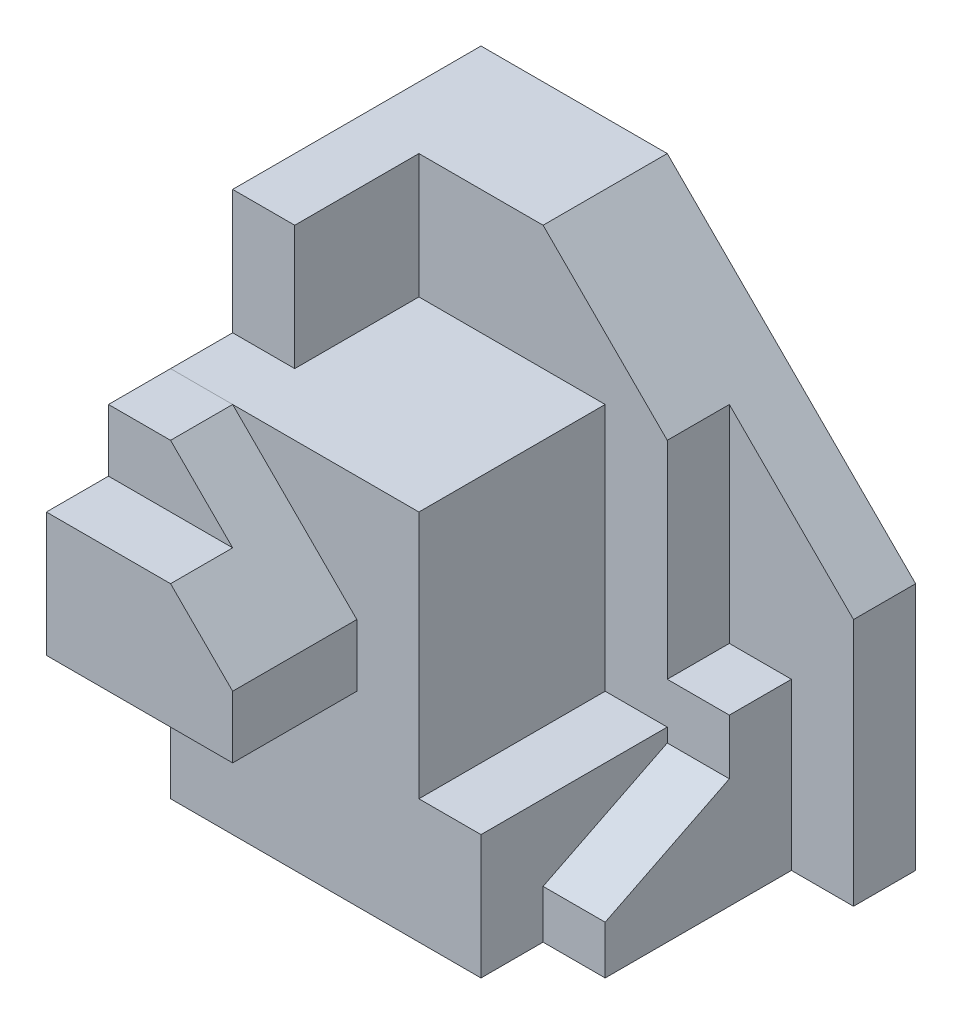
ISO-10303-21;
HEADER;
FILE_DESCRIPTION(('STEP AP214'),'2;1');
FILE_NAME('part.step','',(''),(''),'','','');
FILE_SCHEMA(('AUTOMOTIVE_DESIGN { 1 0 10303 214 1 1 1 1 }'));
ENDSEC;
DATA;
#1=APPLICATION_CONTEXT('core data for automotive mechanical design processes');
#2=APPLICATION_PROTOCOL_DEFINITION('international standard','automotive_design',2000,#1);
#3=PRODUCT_CONTEXT('',#1,'mechanical');
#4=PRODUCT('Part','Part','',(#3));
#5=PRODUCT_RELATED_PRODUCT_CATEGORY('part','',(#4));
#6=PRODUCT_DEFINITION_FORMATION('','',#4);
#7=PRODUCT_DEFINITION_CONTEXT('part definition',#1,'design');
#8=PRODUCT_DEFINITION('design','',#6,#7);
#9=PRODUCT_DEFINITION_SHAPE('','',#8);
#10=(LENGTH_UNIT() NAMED_UNIT(*) SI_UNIT(.MILLI.,.METRE.));
#11=(NAMED_UNIT(*) PLANE_ANGLE_UNIT() SI_UNIT($,.RADIAN.));
#12=(NAMED_UNIT(*) SI_UNIT($,.STERADIAN.) SOLID_ANGLE_UNIT());
#13=UNCERTAINTY_MEASURE_WITH_UNIT(LENGTH_MEASURE(1.E-05),#10,'distance_accuracy_value','');
#14=(GEOMETRIC_REPRESENTATION_CONTEXT(3) GLOBAL_UNCERTAINTY_ASSIGNED_CONTEXT((#13)) GLOBAL_UNIT_ASSIGNED_CONTEXT((#10,
#11,#12)) REPRESENTATION_CONTEXT('',''));
#15=CARTESIAN_POINT('',(0.,0.,0.));
#16=DIRECTION('',(0.,0.,1.));
#17=DIRECTION('',(1.,0.,0.));
#18=AXIS2_PLACEMENT_3D('',#15,#16,#17);
#19=CARTESIAN_POINT('',(-25.,30.,25.));
#20=DIRECTION('',(-1.,0.,0.));
#21=DIRECTION('',(0.,0.,1.));
#22=AXIS2_PLACEMENT_3D('',#19,#20,#21);
#23=PLANE('',#22);
#24=DIRECTION('',(0.,0.,1.));
#25=VECTOR('',#24,1.);
#26=CARTESIAN_POINT('',(-25.,50.,45.));
#27=LINE('',#26,#25);
#28=CARTESIAN_POINT('',(-25.,50.,35.));
#29=VERTEX_POINT('',#28);
#30=CARTESIAN_POINT('',(-25.,50.,45.));
#31=VERTEX_POINT('',#30);
#32=EDGE_CURVE('E109',#29,#31,#27,.T.);
#33=ORIENTED_EDGE('',*,*,#32,.F.);
#34=DIRECTION('',(0.,-1.,0.));
#35=VECTOR('',#34,1.);
#36=CARTESIAN_POINT('',(-25.,60.,35.));
#37=LINE('',#36,#35);
#38=CARTESIAN_POINT('',(-25.,60.,35.));
#39=VERTEX_POINT('',#38);
#40=EDGE_CURVE('E103',#39,#29,#37,.T.);
#41=ORIENTED_EDGE('',*,*,#40,.F.);
#42=DIRECTION('',(0.,0.,1.));
#43=VECTOR('',#42,1.);
#44=CARTESIAN_POINT('',(-25.,60.,25.));
#45=LINE('',#44,#43);
#46=CARTESIAN_POINT('',(-25.,60.,25.));
#47=VERTEX_POINT('',#46);
#48=EDGE_CURVE('E113',#47,#39,#45,.T.);
#49=ORIENTED_EDGE('',*,*,#48,.F.);
#50=DIRECTION('',(0.,1.,0.));
#51=VECTOR('',#50,1.);
#52=CARTESIAN_POINT('',(-25.,30.,25.));
#53=LINE('',#52,#51);
#54=CARTESIAN_POINT('',(-25.,30.,25.));
#55=VERTEX_POINT('',#54);
#56=EDGE_CURVE('E130',#55,#47,#53,.T.);
#57=ORIENTED_EDGE('',*,*,#56,.F.);
#58=DIRECTION('',(0.,0.,1.));
#59=VECTOR('',#58,1.);
#60=CARTESIAN_POINT('',(-25.,30.,25.));
#61=LINE('',#60,#59);
#62=CARTESIAN_POINT('',(-25.,30.,45.));
#63=VERTEX_POINT('',#62);
#64=EDGE_CURVE('E122',#55,#63,#61,.T.);
#65=ORIENTED_EDGE('',*,*,#64,.T.);
#66=DIRECTION('',(0.,1.,0.));
#67=VECTOR('',#66,1.);
#68=CARTESIAN_POINT('',(-25.,30.,45.));
#69=LINE('',#68,#67);
#70=EDGE_CURVE('E137',#63,#31,#69,.T.);
#71=ORIENTED_EDGE('',*,*,#70,.T.);
#72=EDGE_LOOP('',(#33,#41,#49,#57,#65,#71));
#73=FACE_BOUND('',#72,.T.);
#74=ADVANCED_FACE('F43',(#73),#23,.T.);
#75=CARTESIAN_POINT('',(-25.,30.,25.));
#76=DIRECTION('',(0.,0.,-1.));
#77=DIRECTION('',(-1.,0.,0.));
#78=AXIS2_PLACEMENT_3D('',#75,#76,#77);
#79=PLANE('',#78);
#80=DIRECTION('',(-1.,0.,0.));
#81=VECTOR('',#80,1.);
#82=CARTESIAN_POINT('',(-25.,60.,25.));
#83=LINE('',#82,#81);
#84=CARTESIAN_POINT('',(-15.0000000000001,60.,25.));
#85=VERTEX_POINT('',#84);
#86=EDGE_CURVE('E118',#85,#47,#83,.T.);
#87=ORIENTED_EDGE('',*,*,#86,.F.);
#88=DIRECTION('',(-0.707106781186547,0.707106781186548,0.));
#89=VECTOR('',#88,1.);
#90=CARTESIAN_POINT('',(-5.00000000000003,50.,25.));
#91=LINE('',#90,#89);
#92=CARTESIAN_POINT('',(5.,39.9999999999999,25.));
#93=VERTEX_POINT('',#92);
#94=EDGE_CURVE('E140',#85,#93,#91,.F.);
#95=ORIENTED_EDGE('',*,*,#94,.T.);
#96=DIRECTION('',(0.,1.,0.));
#97=VECTOR('',#96,1.);
#98=CARTESIAN_POINT('',(5.,30.,25.));
#99=LINE('',#98,#97);
#100=CARTESIAN_POINT('',(5.,30.,25.));
#101=VERTEX_POINT('',#100);
#102=EDGE_CURVE('E133',#101,#93,#99,.T.);
#103=ORIENTED_EDGE('',*,*,#102,.F.);
#104=DIRECTION('',(-1.,0.,0.));
#105=VECTOR('',#104,1.);
#106=CARTESIAN_POINT('',(-25.,30.,25.));
#107=LINE('',#106,#105);
#108=EDGE_CURVE('E127',#101,#55,#107,.T.);
#109=ORIENTED_EDGE('',*,*,#108,.T.);
#110=ORIENTED_EDGE('',*,*,#56,.T.);
#111=EDGE_LOOP('',(#87,#95,#103,#109,#110));
#112=FACE_BOUND('',#111,.T.);
#113=ADVANCED_FACE('F166',(#112),#79,.T.);
#114=CARTESIAN_POINT('',(5.,30.,25.));
#115=DIRECTION('',(1.,0.,0.));
#116=DIRECTION('',(0.,0.,-1.));
#117=AXIS2_PLACEMENT_3D('',#114,#115,#116);
#118=PLANE('',#117);
#119=ORIENTED_EDGE('',*,*,#102,.T.);
#120=DIRECTION('',(0.,0.,1.));
#121=VECTOR('',#120,1.);
#122=CARTESIAN_POINT('',(5.,39.9999999999999,25.));
#123=LINE('',#122,#121);
#124=CARTESIAN_POINT('',(5.00000000000001,39.9999999999999,45.));
#125=VERTEX_POINT('',#124);
#126=EDGE_CURVE('E65',#93,#125,#123,.T.);
#127=ORIENTED_EDGE('',*,*,#126,.T.);
#128=DIRECTION('',(0.,1.,0.));
#129=VECTOR('',#128,1.);
#130=CARTESIAN_POINT('',(5.,30.,45.));
#131=LINE('',#130,#129);
#132=CARTESIAN_POINT('',(5.,30.,45.));
#133=VERTEX_POINT('',#132);
#134=EDGE_CURVE('E135',#133,#125,#131,.T.);
#135=ORIENTED_EDGE('',*,*,#134,.F.);
#136=DIRECTION('',(0.,0.,-1.));
#137=VECTOR('',#136,1.);
#138=CARTESIAN_POINT('',(5.,30.,25.));
#139=LINE('',#138,#137);
#140=EDGE_CURVE('E160',#133,#101,#139,.T.);
#141=ORIENTED_EDGE('',*,*,#140,.T.);
#142=EDGE_LOOP('',(#119,#127,#135,#141));
#143=FACE_BOUND('',#142,.T.);
#144=ADVANCED_FACE('F178',(#143),#118,.T.);
#145=CARTESIAN_POINT('',(-25.,30.,45.));
#146=DIRECTION('',(0.,0.,1.));
#147=DIRECTION('',(1.,0.,0.));
#148=AXIS2_PLACEMENT_3D('',#145,#146,#147);
#149=PLANE('',#148);
#150=DIRECTION('',(-1.,0.,0.));
#151=VECTOR('',#150,1.);
#152=CARTESIAN_POINT('',(15.,50.,45.));
#153=LINE('',#152,#151);
#154=CARTESIAN_POINT('',(-5.00000000000006,50.,45.));
#155=VERTEX_POINT('',#154);
#156=EDGE_CURVE('E120',#155,#31,#153,.T.);
#157=ORIENTED_EDGE('',*,*,#156,.T.);
#158=ORIENTED_EDGE('',*,*,#70,.F.);
#159=DIRECTION('',(1.,0.,0.));
#160=VECTOR('',#159,1.);
#161=CARTESIAN_POINT('',(-25.,30.,45.));
#162=LINE('',#161,#160);
#163=EDGE_CURVE('E159',#63,#133,#162,.T.);
#164=ORIENTED_EDGE('',*,*,#163,.T.);
#165=ORIENTED_EDGE('',*,*,#134,.T.);
#166=DIRECTION('',(0.707106781186547,-0.707106781186548,0.));
#167=VECTOR('',#166,1.);
#168=CARTESIAN_POINT('',(-5.00000000000002,50.,45.));
#169=LINE('',#168,#167);
#170=EDGE_CURVE('E143',#125,#155,#169,.F.);
#171=ORIENTED_EDGE('',*,*,#170,.T.);
#172=EDGE_LOOP('',(#157,#158,#164,#165,#171));
#173=FACE_BOUND('',#172,.T.);
#174=ADVANCED_FACE('F147',(#173),#149,.T.);
#175=CARTESIAN_POINT('',(0.,30.,0.));
#176=DIRECTION('',(0.,1.,0.));
#177=DIRECTION('',(0.,0.,1.));
#178=AXIS2_PLACEMENT_3D('',#175,#176,#177);
#179=PLANE('',#178);
#180=ORIENTED_EDGE('',*,*,#64,.F.);
#181=ORIENTED_EDGE('',*,*,#108,.F.);
#182=ORIENTED_EDGE('',*,*,#140,.F.);
#183=ORIENTED_EDGE('',*,*,#163,.F.);
#184=EDGE_LOOP('',(#180,#181,#182,#183));
#185=FACE_BOUND('',#184,.T.);
#186=ADVANCED_FACE('F169',(#185),#179,.F.);
#187=CARTESIAN_POINT('',(0.,60.,0.));
#188=DIRECTION('',(0.,1.,0.));
#189=DIRECTION('',(0.,0.,1.));
#190=AXIS2_PLACEMENT_3D('',#187,#188,#189);
#191=PLANE('',#190);
#192=DIRECTION('',(-1.,0.,0.));
#193=VECTOR('',#192,1.);
#194=CARTESIAN_POINT('',(15.,60.,35.));
#195=LINE('',#194,#193);
#196=CARTESIAN_POINT('',(-15.0000000000001,60.,35.));
#197=VERTEX_POINT('',#196);
#198=EDGE_CURVE('E100',#197,#39,#195,.T.);
#199=ORIENTED_EDGE('',*,*,#198,.F.);
#200=DIRECTION('',(0.,0.,-1.));
#201=VECTOR('',#200,1.);
#202=CARTESIAN_POINT('',(-15.0000000000001,60.,0.));
#203=LINE('',#202,#201);
#204=EDGE_CURVE('E132',#197,#85,#203,.T.);
#205=ORIENTED_EDGE('',*,*,#204,.T.);
#206=ORIENTED_EDGE('',*,*,#86,.T.);
#207=ORIENTED_EDGE('',*,*,#48,.T.);
#208=EDGE_LOOP('',(#199,#205,#206,#207));
#209=FACE_BOUND('',#208,.T.);
#210=ADVANCED_FACE('F116',(#209),#191,.T.);
#211=CARTESIAN_POINT('',(-15.0000000000001,60.,0.));
#212=DIRECTION('',(-0.707106781186548,-0.707106781186547,0.));
#213=DIRECTION('',(0.,0.,-1.));
#214=AXIS2_PLACEMENT_3D('',#211,#212,#213);
#215=PLANE('',#214);
#216=DIRECTION('',(0.,0.,1.));
#217=VECTOR('',#216,1.);
#218=CARTESIAN_POINT('',(-5.00000000000007,50.,0.));
#219=LINE('',#218,#217);
#220=CARTESIAN_POINT('',(-5.00000000000006,50.,35.));
#221=VERTEX_POINT('',#220);
#222=EDGE_CURVE('E12',#155,#221,#219,.F.);
#223=ORIENTED_EDGE('',*,*,#222,.F.);
#224=ORIENTED_EDGE('',*,*,#170,.F.);
#225=ORIENTED_EDGE('',*,*,#126,.F.);
#226=ORIENTED_EDGE('',*,*,#94,.F.);
#227=ORIENTED_EDGE('',*,*,#204,.F.);
#228=DIRECTION('',(0.707106781186547,-0.707106781186548,0.));
#229=VECTOR('',#228,1.);
#230=CARTESIAN_POINT('',(-15.0000000000001,60.,35.));
#231=LINE('',#230,#229);
#232=EDGE_CURVE('E51',#221,#197,#231,.F.);
#233=ORIENTED_EDGE('',*,*,#232,.F.);
#234=EDGE_LOOP('',(#223,#224,#225,#226,#227,#233));
#235=FACE_BOUND('',#234,.T.);
#236=ADVANCED_FACE('F45',(#235),#215,.F.);
#237=CARTESIAN_POINT('',(15.,50.,45.));
#238=DIRECTION('',(0.,-1.,0.));
#239=DIRECTION('',(0.,0.,-1.));
#240=AXIS2_PLACEMENT_3D('',#237,#238,#239);
#241=PLANE('',#240);
#242=ORIENTED_EDGE('',*,*,#222,.T.);
#243=DIRECTION('',(-1.,0.,0.));
#244=VECTOR('',#243,1.);
#245=CARTESIAN_POINT('',(15.,50.,35.));
#246=LINE('',#245,#244);
#247=EDGE_CURVE('E58',#221,#29,#246,.T.);
#248=ORIENTED_EDGE('',*,*,#247,.T.);
#249=ORIENTED_EDGE('',*,*,#32,.T.);
#250=ORIENTED_EDGE('',*,*,#156,.F.);
#251=EDGE_LOOP('',(#242,#248,#249,#250));
#252=FACE_BOUND('',#251,.T.);
#253=ADVANCED_FACE('F153',(#252),#241,.F.);
#254=CARTESIAN_POINT('',(15.,60.,35.));
#255=DIRECTION('',(0.,0.,-1.));
#256=DIRECTION('',(-1.,0.,0.));
#257=AXIS2_PLACEMENT_3D('',#254,#255,#256);
#258=PLANE('',#257);
#259=ORIENTED_EDGE('',*,*,#232,.T.);
#260=ORIENTED_EDGE('',*,*,#198,.T.);
#261=ORIENTED_EDGE('',*,*,#40,.T.);
#262=ORIENTED_EDGE('',*,*,#247,.F.);
#263=EDGE_LOOP('',(#259,#260,#261,#262));
#264=FACE_BOUND('',#263,.T.);
#265=ADVANCED_FACE('F102',(#264),#258,.F.);
#266=CLOSED_SHELL('',(#74,#113,#144,#174,#186,#210,#236,#253,#265));
#267=MANIFOLD_SOLID_BREP('B2',#266);
#268=CARTESIAN_POINT('',(25.,60.,25.));
#269=DIRECTION('',(-1.,0.,0.));
#270=DIRECTION('',(0.,0.,1.));
#271=AXIS2_PLACEMENT_3D('',#268,#269,#270);
#272=PLANE('',#271);
#273=DIRECTION('',(0.,0.,1.));
#274=VECTOR('',#273,1.);
#275=CARTESIAN_POINT('',(25.,26.6693121097361,-5.));
#276=LINE('',#275,#274);
#277=CARTESIAN_POINT('',(25.,26.6693121097361,-15.));
#278=VERTEX_POINT('',#277);
#279=CARTESIAN_POINT('',(25.,26.6693121097361,-5.));
#280=VERTEX_POINT('',#279);
#281=EDGE_CURVE('E390',#278,#280,#276,.T.);
#282=ORIENTED_EDGE('',*,*,#281,.F.);
#283=DIRECTION('',(0.,-1.,0.));
#284=VECTOR('',#283,1.);
#285=CARTESIAN_POINT('',(25.,0.,-15.));
#286=LINE('',#285,#284);
#287=CARTESIAN_POINT('',(25.,59.9999999999999,-15.));
#288=VERTEX_POINT('',#287);
#289=EDGE_CURVE('E434',#288,#278,#286,.T.);
#290=ORIENTED_EDGE('',*,*,#289,.F.);
#291=DIRECTION('',(0.,0.,1.));
#292=VECTOR('',#291,1.);
#293=CARTESIAN_POINT('',(25.,59.9999999999999,0.));
#294=LINE('',#293,#292);
#295=CARTESIAN_POINT('',(25.,59.9999999999999,-5.));
#296=VERTEX_POINT('',#295);
#297=EDGE_CURVE('E443',#288,#296,#294,.T.);
#298=ORIENTED_EDGE('',*,*,#297,.T.);
#299=DIRECTION('',(0.,1.,0.));
#300=VECTOR('',#299,1.);
#301=CARTESIAN_POINT('',(25.,20.,-5.));
#302=LINE('',#301,#300);
#303=EDGE_CURVE('E509',#280,#296,#302,.T.);
#304=ORIENTED_EDGE('',*,*,#303,.F.);
#305=EDGE_LOOP('',(#282,#290,#298,#304));
#306=FACE_BOUND('',#305,.T.);
#307=ADVANCED_FACE('F245',(#306),#272,.F.);
#308=DIRECTION('',(0.,-1.,0.));
#309=VECTOR('',#308,1.);
#310=CARTESIAN_POINT('',(25.,17.7822035162268,-5.));
#311=LINE('',#310,#309);
#312=CARTESIAN_POINT('',(25.,20.,-5.));
#313=VERTEX_POINT('',#312);
#314=CARTESIAN_POINT('',(25.,17.7822035162268,-5.));
#315=VERTEX_POINT('',#314);
#316=EDGE_CURVE('E532',#313,#315,#311,.T.);
#317=ORIENTED_EDGE('',*,*,#316,.F.);
#318=DIRECTION('',(0.,0.,-1.));
#319=VECTOR('',#318,1.);
#320=CARTESIAN_POINT('',(25.,20.,25.));
#321=LINE('',#320,#319);
#322=CARTESIAN_POINT('',(25.,20.,25.));
#323=VERTEX_POINT('',#322);
#324=EDGE_CURVE('E518',#323,#313,#321,.T.);
#325=ORIENTED_EDGE('',*,*,#324,.F.);
#326=DIRECTION('',(0.,-1.,0.));
#327=VECTOR('',#326,1.);
#328=CARTESIAN_POINT('',(25.,60.,25.));
#329=LINE('',#328,#327);
#330=CARTESIAN_POINT('',(25.,0.,25.));
#331=VERTEX_POINT('',#330);
#332=EDGE_CURVE('E499',#323,#331,#329,.T.);
#333=ORIENTED_EDGE('',*,*,#332,.T.);
#334=DIRECTION('',(0.,0.,-1.));
#335=VECTOR('',#334,1.);
#336=CARTESIAN_POINT('',(25.,0.,25.));
#337=LINE('',#336,#335);
#338=CARTESIAN_POINT('',(25.,0.,15.));
#339=VERTEX_POINT('',#338);
#340=EDGE_CURVE('E482',#331,#339,#337,.T.);
#341=ORIENTED_EDGE('',*,*,#340,.T.);
#342=DIRECTION('',(0.,-1.,0.));
#343=VECTOR('',#342,1.);
#344=CARTESIAN_POINT('',(25.,0.,15.));
#345=LINE('',#344,#343);
#346=CARTESIAN_POINT('',(25.,7.78220351622677,15.));
#347=VERTEX_POINT('',#346);
#348=EDGE_CURVE('E265',#347,#339,#345,.T.);
#349=ORIENTED_EDGE('',*,*,#348,.F.);
#350=DIRECTION('',(0.,-0.447213595499958,0.894427190999916));
#351=VECTOR('',#350,1.);
#352=CARTESIAN_POINT('',(25.,7.78220351622677,15.));
#353=LINE('',#352,#351);
#354=EDGE_CURVE('E260',#315,#347,#353,.T.);
#355=ORIENTED_EDGE('',*,*,#354,.F.);
#356=EDGE_LOOP('',(#317,#325,#333,#341,#349,#355));
#357=FACE_BOUND('',#356,.T.);
#358=ADVANCED_FACE('F531',(#357),#272,.F.);
#359=CARTESIAN_POINT('',(45.,0.,-15.));
#360=DIRECTION('',(0.,0.,-1.));
#361=DIRECTION('',(-1.,0.,0.));
#362=AXIS2_PLACEMENT_3D('',#359,#360,#361);
#363=PLANE('',#362);
#364=DIRECTION('',(-1.,0.,0.));
#365=VECTOR('',#364,1.);
#366=CARTESIAN_POINT('',(35.,26.6693121097361,-15.));
#367=LINE('',#366,#365);
#368=CARTESIAN_POINT('',(35.,26.6693121097361,-15.));
#369=VERTEX_POINT('',#368);
#370=EDGE_CURVE('E548',#369,#278,#367,.T.);
#371=ORIENTED_EDGE('',*,*,#370,.F.);
#372=DIRECTION('',(0.,1.,0.));
#373=VECTOR('',#372,1.);
#374=CARTESIAN_POINT('',(35.,26.6693121097361,-15.));
#375=LINE('',#374,#373);
#376=CARTESIAN_POINT('',(35.,0.,-15.));
#377=VERTEX_POINT('',#376);
#378=EDGE_CURVE('E385',#377,#369,#375,.T.);
#379=ORIENTED_EDGE('',*,*,#378,.F.);
#380=DIRECTION('',(-1.,0.,0.));
#381=VECTOR('',#380,1.);
#382=CARTESIAN_POINT('',(45.,0.,-15.));
#383=LINE('',#382,#381);
#384=CARTESIAN_POINT('',(45.,0.,-15.));
#385=VERTEX_POINT('',#384);
#386=EDGE_CURVE('E428',#385,#377,#383,.T.);
#387=ORIENTED_EDGE('',*,*,#386,.F.);
#388=DIRECTION('',(0.,-1.,0.));
#389=VECTOR('',#388,1.);
#390=CARTESIAN_POINT('',(45.,0.,-15.));
#391=LINE('',#390,#389);
#392=CARTESIAN_POINT('',(45.,39.9999999999999,-15.));
#393=VERTEX_POINT('',#392);
#394=EDGE_CURVE('E423',#393,#385,#391,.T.);
#395=ORIENTED_EDGE('',*,*,#394,.F.);
#396=DIRECTION('',(-0.707106781186548,0.707106781186548,0.));
#397=VECTOR('',#396,1.);
#398=CARTESIAN_POINT('',(45.,39.9999999999999,-15.));
#399=LINE('',#398,#397);
#400=EDGE_CURVE('E441',#393,#288,#399,.T.);
#401=ORIENTED_EDGE('',*,*,#400,.T.);
#402=ORIENTED_EDGE('',*,*,#289,.T.);
#403=EDGE_LOOP('',(#371,#379,#387,#395,#401,#402));
#404=FACE_BOUND('',#403,.T.);
#405=ADVANCED_FACE('F470',(#404),#363,.F.);
#406=CARTESIAN_POINT('',(0.,60.,0.));
#407=DIRECTION('',(0.,-1.,0.));
#408=DIRECTION('',(0.,0.,-1.));
#409=AXIS2_PLACEMENT_3D('',#406,#407,#408);
#410=PLANE('',#409);
#411=DIRECTION('',(1.,0.,0.));
#412=VECTOR('',#411,1.);
#413=CARTESIAN_POINT('',(-25.,60.,15.));
#414=LINE('',#413,#412);
#415=CARTESIAN_POINT('',(-25.,60.,15.));
#416=VERTEX_POINT('',#415);
#417=CARTESIAN_POINT('',(-15.,60.,15.));
#418=VERTEX_POINT('',#417);
#419=EDGE_CURVE('E391',#416,#418,#414,.T.);
#420=ORIENTED_EDGE('',*,*,#419,.F.);
#421=DIRECTION('',(0.,0.,1.));
#422=VECTOR('',#421,1.);
#423=CARTESIAN_POINT('',(-25.,60.,25.));
#424=LINE('',#423,#422);
#425=CARTESIAN_POINT('',(-25.,60.,25.));
#426=VERTEX_POINT('',#425);
#427=EDGE_CURVE('E495',#416,#426,#424,.T.);
#428=ORIENTED_EDGE('',*,*,#427,.T.);
#429=DIRECTION('',(1.,0.,0.));
#430=VECTOR('',#429,1.);
#431=CARTESIAN_POINT('',(-25.,60.,25.));
#432=LINE('',#431,#430);
#433=CARTESIAN_POINT('',(15.,60.,25.));
#434=VERTEX_POINT('',#433);
#435=EDGE_CURVE('E501',#426,#434,#432,.T.);
#436=ORIENTED_EDGE('',*,*,#435,.T.);
#437=DIRECTION('',(0.,0.,1.));
#438=VECTOR('',#437,1.);
#439=CARTESIAN_POINT('',(15.,60.,25.));
#440=LINE('',#439,#438);
#441=CARTESIAN_POINT('',(15.,60.,-5.));
#442=VERTEX_POINT('',#441);
#443=EDGE_CURVE('E461',#442,#434,#440,.T.);
#444=ORIENTED_EDGE('',*,*,#443,.F.);
#445=DIRECTION('',(1.,0.,0.));
#446=VECTOR('',#445,1.);
#447=CARTESIAN_POINT('',(-15.,60.,-5.));
#448=LINE('',#447,#446);
#449=CARTESIAN_POINT('',(-15.,60.,-5.));
#450=VERTEX_POINT('',#449);
#451=EDGE_CURVE('E403',#450,#442,#448,.T.);
#452=ORIENTED_EDGE('',*,*,#451,.F.);
#453=DIRECTION('',(0.,0.,-1.));
#454=VECTOR('',#453,1.);
#455=CARTESIAN_POINT('',(-15.,60.,15.));
#456=LINE('',#455,#454);
#457=EDGE_CURVE('E393',#418,#450,#456,.T.);
#458=ORIENTED_EDGE('',*,*,#457,.F.);
#459=EDGE_LOOP('',(#420,#428,#436,#444,#452,#458));
#460=FACE_BOUND('',#459,.T.);
#461=ADVANCED_FACE('F575',(#460),#410,.F.);
#462=CARTESIAN_POINT('',(-25.,60.,-25.));
#463=DIRECTION('',(0.,0.,1.));
#464=DIRECTION('',(1.,0.,0.));
#465=AXIS2_PLACEMENT_3D('',#462,#463,#464);
#466=PLANE('',#465);
#467=DIRECTION('',(-1.,0.,0.));
#468=VECTOR('',#467,1.);
#469=CARTESIAN_POINT('',(45.,80.,-25.));
#470=LINE('',#469,#468);
#471=CARTESIAN_POINT('',(4.99999999999986,80.,-25.));
#472=VERTEX_POINT('',#471);
#473=CARTESIAN_POINT('',(-25.,80.,-25.));
#474=VERTEX_POINT('',#473);
#475=EDGE_CURVE('E431',#472,#474,#470,.T.);
#476=ORIENTED_EDGE('',*,*,#475,.F.);
#477=DIRECTION('',(0.707106781186548,-0.707106781186548,0.));
#478=VECTOR('',#477,1.);
#479=CARTESIAN_POINT('',(45.,39.9999999999999,-25.));
#480=LINE('',#479,#478);
#481=CARTESIAN_POINT('',(45.,39.9999999999999,-25.));
#482=VERTEX_POINT('',#481);
#483=EDGE_CURVE('E41',#472,#482,#480,.T.);
#484=ORIENTED_EDGE('',*,*,#483,.T.);
#485=DIRECTION('',(0.,1.,0.));
#486=VECTOR('',#485,1.);
#487=CARTESIAN_POINT('',(45.,0.,-25.));
#488=LINE('',#487,#486);
#489=CARTESIAN_POINT('',(45.,0.,-25.));
#490=VERTEX_POINT('',#489);
#491=EDGE_CURVE('E420',#490,#482,#488,.T.);
#492=ORIENTED_EDGE('',*,*,#491,.F.);
#493=DIRECTION('',(-1.,0.,0.));
#494=VECTOR('',#493,1.);
#495=CARTESIAN_POINT('',(-25.,0.,-25.));
#496=LINE('',#495,#494);
#497=CARTESIAN_POINT('',(-25.,0.,-25.));
#498=VERTEX_POINT('',#497);
#499=EDGE_CURVE('E480',#490,#498,#496,.T.);
#500=ORIENTED_EDGE('',*,*,#499,.T.);
#501=DIRECTION('',(0.,-1.,0.));
#502=VECTOR('',#501,1.);
#503=CARTESIAN_POINT('',(-25.,60.,-25.));
#504=LINE('',#503,#502);
#505=EDGE_CURVE('E439',#474,#498,#504,.T.);
#506=ORIENTED_EDGE('',*,*,#505,.F.);
#507=EDGE_LOOP('',(#476,#484,#492,#500,#506));
#508=FACE_BOUND('',#507,.T.);
#509=ADVANCED_FACE('F457',(#508),#466,.F.);
#510=CARTESIAN_POINT('',(-25.,60.,25.));
#511=DIRECTION('',(1.,0.,0.));
#512=DIRECTION('',(0.,0.,-1.));
#513=AXIS2_PLACEMENT_3D('',#510,#511,#512);
#514=PLANE('',#513);
#515=DIRECTION('',(0.,0.,1.));
#516=VECTOR('',#515,1.);
#517=CARTESIAN_POINT('',(-25.,0.,25.));
#518=LINE('',#517,#516);
#519=CARTESIAN_POINT('',(-25.,0.,25.));
#520=VERTEX_POINT('',#519);
#521=EDGE_CURVE('E481',#498,#520,#518,.T.);
#522=ORIENTED_EDGE('',*,*,#521,.T.);
#523=DIRECTION('',(0.,-1.,0.));
#524=VECTOR('',#523,1.);
#525=CARTESIAN_POINT('',(-25.,60.,25.));
#526=LINE('',#525,#524);
#527=EDGE_CURVE('E489',#426,#520,#526,.T.);
#528=ORIENTED_EDGE('',*,*,#527,.F.);
#529=ORIENTED_EDGE('',*,*,#427,.F.);
#530=DIRECTION('',(0.,-1.,0.));
#531=VECTOR('',#530,1.);
#532=CARTESIAN_POINT('',(-25.,80.,15.));
#533=LINE('',#532,#531);
#534=CARTESIAN_POINT('',(-25.,80.,15.));
#535=VERTEX_POINT('',#534);
#536=EDGE_CURVE('E418',#535,#416,#533,.T.);
#537=ORIENTED_EDGE('',*,*,#536,.F.);
#538=DIRECTION('',(0.,0.,1.));
#539=VECTOR('',#538,1.);
#540=CARTESIAN_POINT('',(-25.,80.,15.));
#541=LINE('',#540,#539);
#542=EDGE_CURVE('E399',#474,#535,#541,.T.);
#543=ORIENTED_EDGE('',*,*,#542,.F.);
#544=ORIENTED_EDGE('',*,*,#505,.T.);
#545=EDGE_LOOP('',(#522,#528,#529,#537,#543,#544));
#546=FACE_BOUND('',#545,.T.);
#547=ADVANCED_FACE('F485',(#546),#514,.F.);
#548=CARTESIAN_POINT('',(-25.,60.,25.));
#549=DIRECTION('',(0.,0.,-1.));
#550=DIRECTION('',(-1.,0.,0.));
#551=AXIS2_PLACEMENT_3D('',#548,#549,#550);
#552=PLANE('',#551);
#553=DIRECTION('',(1.,0.,0.));
#554=VECTOR('',#553,1.);
#555=CARTESIAN_POINT('',(25.,20.,25.));
#556=LINE('',#555,#554);
#557=CARTESIAN_POINT('',(15.,20.,25.));
#558=VERTEX_POINT('',#557);
#559=EDGE_CURVE('E512',#558,#323,#556,.T.);
#560=ORIENTED_EDGE('',*,*,#559,.F.);
#561=DIRECTION('',(0.,1.,0.));
#562=VECTOR('',#561,1.);
#563=CARTESIAN_POINT('',(15.,20.,25.));
#564=LINE('',#563,#562);
#565=EDGE_CURVE('E503',#558,#434,#564,.T.);
#566=ORIENTED_EDGE('',*,*,#565,.T.);
#567=ORIENTED_EDGE('',*,*,#435,.F.);
#568=ORIENTED_EDGE('',*,*,#527,.T.);
#569=DIRECTION('',(1.,0.,0.));
#570=VECTOR('',#569,1.);
#571=CARTESIAN_POINT('',(-25.,0.,25.));
#572=LINE('',#571,#570);
#573=EDGE_CURVE('E493',#520,#331,#572,.T.);
#574=ORIENTED_EDGE('',*,*,#573,.T.);
#575=ORIENTED_EDGE('',*,*,#332,.F.);
#576=EDGE_LOOP('',(#560,#566,#567,#568,#574,#575));
#577=FACE_BOUND('',#576,.T.);
#578=ADVANCED_FACE('F534',(#577),#552,.F.);
#579=CARTESIAN_POINT('',(0.,0.,0.));
#580=DIRECTION('',(0.,-1.,0.));
#581=DIRECTION('',(0.,0.,-1.));
#582=AXIS2_PLACEMENT_3D('',#579,#580,#581);
#583=PLANE('',#582);
#584=ORIENTED_EDGE('',*,*,#340,.F.);
#585=ORIENTED_EDGE('',*,*,#573,.F.);
#586=ORIENTED_EDGE('',*,*,#521,.F.);
#587=ORIENTED_EDGE('',*,*,#499,.F.);
#588=DIRECTION('',(0.,0.,-1.));
#589=VECTOR('',#588,1.);
#590=CARTESIAN_POINT('',(45.,0.,-25.));
#591=LINE('',#590,#589);
#592=EDGE_CURVE('E425',#385,#490,#591,.T.);
#593=ORIENTED_EDGE('',*,*,#592,.F.);
#594=ORIENTED_EDGE('',*,*,#386,.T.);
#595=DIRECTION('',(0.,0.,-1.));
#596=VECTOR('',#595,1.);
#597=CARTESIAN_POINT('',(35.,0.,-15.));
#598=LINE('',#597,#596);
#599=CARTESIAN_POINT('',(35.,0.,15.));
#600=VERTEX_POINT('',#599);
#601=EDGE_CURVE('E550',#600,#377,#598,.T.);
#602=ORIENTED_EDGE('',*,*,#601,.F.);
#603=DIRECTION('',(-1.,0.,0.));
#604=VECTOR('',#603,1.);
#605=CARTESIAN_POINT('',(35.,0.,15.));
#606=LINE('',#605,#604);
#607=EDGE_CURVE('E538',#600,#339,#606,.T.);
#608=ORIENTED_EDGE('',*,*,#607,.T.);
#609=EDGE_LOOP('',(#584,#585,#586,#587,#593,#594,#602,#608));
#610=FACE_BOUND('',#609,.T.);
#611=ADVANCED_FACE('F478',(#610),#583,.T.);
#612=CARTESIAN_POINT('',(15.,20.,25.));
#613=DIRECTION('',(-1.,0.,0.));
#614=DIRECTION('',(0.,0.,1.));
#615=AXIS2_PLACEMENT_3D('',#612,#613,#614);
#616=PLANE('',#615);
#617=ORIENTED_EDGE('',*,*,#443,.T.);
#618=ORIENTED_EDGE('',*,*,#565,.F.);
#619=DIRECTION('',(0.,0.,1.));
#620=VECTOR('',#619,1.);
#621=CARTESIAN_POINT('',(15.,20.,25.));
#622=LINE('',#621,#620);
#623=CARTESIAN_POINT('',(15.,20.,-5.));
#624=VERTEX_POINT('',#623);
#625=EDGE_CURVE('E520',#624,#558,#622,.T.);
#626=ORIENTED_EDGE('',*,*,#625,.F.);
#627=DIRECTION('',(0.,1.,0.));
#628=VECTOR('',#627,1.);
#629=CARTESIAN_POINT('',(15.,20.,-5.));
#630=LINE('',#629,#628);
#631=EDGE_CURVE('E511',#624,#442,#630,.T.);
#632=ORIENTED_EDGE('',*,*,#631,.T.);
#633=EDGE_LOOP('',(#617,#618,#626,#632));
#634=FACE_BOUND('',#633,.T.);
#635=ADVANCED_FACE('F582',(#634),#616,.F.);
#636=CARTESIAN_POINT('',(25.,20.,-5.));
#637=DIRECTION('',(0.,0.,-1.));
#638=DIRECTION('',(-1.,0.,0.));
#639=AXIS2_PLACEMENT_3D('',#636,#637,#638);
#640=PLANE('',#639);
#641=DIRECTION('',(-1.,0.,0.));
#642=VECTOR('',#641,1.);
#643=CARTESIAN_POINT('',(25.,20.,-5.));
#644=LINE('',#643,#642);
#645=EDGE_CURVE('E523',#313,#624,#644,.T.);
#646=ORIENTED_EDGE('',*,*,#645,.F.);
#647=ORIENTED_EDGE('',*,*,#316,.T.);
#648=DIRECTION('',(-1.,0.,0.));
#649=VECTOR('',#648,1.);
#650=CARTESIAN_POINT('',(35.,17.7822035162268,-5.));
#651=LINE('',#650,#649);
#652=CARTESIAN_POINT('',(35.,17.7822035162268,-5.));
#653=VERTEX_POINT('',#652);
#654=EDGE_CURVE('E375',#653,#315,#651,.T.);
#655=ORIENTED_EDGE('',*,*,#654,.F.);
#656=DIRECTION('',(0.,-1.,0.));
#657=VECTOR('',#656,1.);
#658=CARTESIAN_POINT('',(35.,17.7822035162268,-5.));
#659=LINE('',#658,#657);
#660=CARTESIAN_POINT('',(35.,26.6693121097361,-5.));
#661=VERTEX_POINT('',#660);
#662=EDGE_CURVE('E367',#661,#653,#659,.T.);
#663=ORIENTED_EDGE('',*,*,#662,.F.);
#664=DIRECTION('',(-1.,0.,0.));
#665=VECTOR('',#664,1.);
#666=CARTESIAN_POINT('',(35.,26.6693121097361,-5.));
#667=LINE('',#666,#665);
#668=EDGE_CURVE('E372',#661,#280,#667,.T.);
#669=ORIENTED_EDGE('',*,*,#668,.T.);
#670=ORIENTED_EDGE('',*,*,#303,.T.);
#671=DIRECTION('',(-0.707106781186548,0.707106781186548,0.));
#672=VECTOR('',#671,1.);
#673=CARTESIAN_POINT('',(45.,39.9999999999999,-5.));
#674=LINE('',#673,#672);
#675=CARTESIAN_POINT('',(4.99999999999985,80.,-5.));
#676=VERTEX_POINT('',#675);
#677=EDGE_CURVE('E446',#296,#676,#674,.T.);
#678=ORIENTED_EDGE('',*,*,#677,.T.);
#679=DIRECTION('',(1.,0.,0.));
#680=VECTOR('',#679,1.);
#681=CARTESIAN_POINT('',(-15.,80.,-5.));
#682=LINE('',#681,#680);
#683=CARTESIAN_POINT('',(-15.,80.,-5.));
#684=VERTEX_POINT('',#683);
#685=EDGE_CURVE('E407',#684,#676,#682,.T.);
#686=ORIENTED_EDGE('',*,*,#685,.F.);
#687=DIRECTION('',(0.,-1.,0.));
#688=VECTOR('',#687,1.);
#689=CARTESIAN_POINT('',(-15.,80.,-5.));
#690=LINE('',#689,#688);
#691=EDGE_CURVE('E409',#684,#450,#690,.T.);
#692=ORIENTED_EDGE('',*,*,#691,.T.);
#693=ORIENTED_EDGE('',*,*,#451,.T.);
#694=ORIENTED_EDGE('',*,*,#631,.F.);
#695=EDGE_LOOP('',(#646,#647,#655,#663,#669,#670,#678,#686,#692,#693,#694));
#696=FACE_BOUND('',#695,.T.);
#697=ADVANCED_FACE('F370',(#696),#640,.F.);
#698=CARTESIAN_POINT('',(0.,20.,0.));
#699=DIRECTION('',(0.,1.,0.));
#700=DIRECTION('',(0.,0.,1.));
#701=AXIS2_PLACEMENT_3D('',#698,#699,#700);
#702=PLANE('',#701);
#703=ORIENTED_EDGE('',*,*,#324,.T.);
#704=ORIENTED_EDGE('',*,*,#645,.T.);
#705=ORIENTED_EDGE('',*,*,#625,.T.);
#706=ORIENTED_EDGE('',*,*,#559,.T.);
#707=EDGE_LOOP('',(#703,#704,#705,#706));
#708=FACE_BOUND('',#707,.T.);
#709=ADVANCED_FACE('F528',(#708),#702,.T.);
#710=CARTESIAN_POINT('',(45.,80.,-25.));
#711=DIRECTION('',(0.,-1.,0.));
#712=DIRECTION('',(0.,0.,-1.));
#713=AXIS2_PLACEMENT_3D('',#710,#711,#712);
#714=PLANE('',#713);
#715=ORIENTED_EDGE('',*,*,#685,.T.);
#716=DIRECTION('',(0.,0.,-1.));
#717=VECTOR('',#716,1.);
#718=CARTESIAN_POINT('',(4.99999999999985,80.,-25.));
#719=LINE('',#718,#717);
#720=EDGE_CURVE('E253',#676,#472,#719,.T.);
#721=ORIENTED_EDGE('',*,*,#720,.T.);
#722=ORIENTED_EDGE('',*,*,#475,.T.);
#723=ORIENTED_EDGE('',*,*,#542,.T.);
#724=DIRECTION('',(1.,0.,0.));
#725=VECTOR('',#724,1.);
#726=CARTESIAN_POINT('',(-25.,80.,15.));
#727=LINE('',#726,#725);
#728=CARTESIAN_POINT('',(-15.,80.,15.));
#729=VERTEX_POINT('',#728);
#730=EDGE_CURVE('E402',#535,#729,#727,.T.);
#731=ORIENTED_EDGE('',*,*,#730,.T.);
#732=DIRECTION('',(0.,0.,-1.));
#733=VECTOR('',#732,1.);
#734=CARTESIAN_POINT('',(-15.,80.,15.));
#735=LINE('',#734,#733);
#736=EDGE_CURVE('E405',#729,#684,#735,.T.);
#737=ORIENTED_EDGE('',*,*,#736,.T.);
#738=EDGE_LOOP('',(#715,#721,#722,#723,#731,#737));
#739=FACE_BOUND('',#738,.T.);
#740=ADVANCED_FACE('F450',(#739),#714,.F.);
#741=CARTESIAN_POINT('',(45.,0.,0.));
#742=DIRECTION('',(1.,0.,0.));
#743=DIRECTION('',(0.,0.,-1.));
#744=AXIS2_PLACEMENT_3D('',#741,#742,#743);
#745=PLANE('',#744);
#746=ORIENTED_EDGE('',*,*,#491,.T.);
#747=DIRECTION('',(0.,0.,1.));
#748=VECTOR('',#747,1.);
#749=CARTESIAN_POINT('',(45.,39.9999999999999,-14.9999999999999));
#750=LINE('',#749,#748);
#751=EDGE_CURVE('E438',#482,#393,#750,.T.);
#752=ORIENTED_EDGE('',*,*,#751,.T.);
#753=ORIENTED_EDGE('',*,*,#394,.T.);
#754=ORIENTED_EDGE('',*,*,#592,.T.);
#755=EDGE_LOOP('',(#746,#752,#753,#754));
#756=FACE_BOUND('',#755,.T.);
#757=ADVANCED_FACE('F467',(#756),#745,.T.);
#758=CARTESIAN_POINT('',(-25.,80.,15.));
#759=DIRECTION('',(0.,0.,-1.));
#760=DIRECTION('',(-1.,0.,0.));
#761=AXIS2_PLACEMENT_3D('',#758,#759,#760);
#762=PLANE('',#761);
#763=ORIENTED_EDGE('',*,*,#419,.T.);
#764=DIRECTION('',(0.,-1.,0.));
#765=VECTOR('',#764,1.);
#766=CARTESIAN_POINT('',(-15.,80.,15.));
#767=LINE('',#766,#765);
#768=EDGE_CURVE('E415',#729,#418,#767,.T.);
#769=ORIENTED_EDGE('',*,*,#768,.F.);
#770=ORIENTED_EDGE('',*,*,#730,.F.);
#771=ORIENTED_EDGE('',*,*,#536,.T.);
#772=EDGE_LOOP('',(#763,#769,#770,#771));
#773=FACE_BOUND('',#772,.T.);
#774=ADVANCED_FACE('F599',(#773),#762,.F.);
#775=CARTESIAN_POINT('',(-15.,80.,15.));
#776=DIRECTION('',(-1.,0.,0.));
#777=DIRECTION('',(0.,0.,1.));
#778=AXIS2_PLACEMENT_3D('',#775,#776,#777);
#779=PLANE('',#778);
#780=ORIENTED_EDGE('',*,*,#457,.T.);
#781=ORIENTED_EDGE('',*,*,#691,.F.);
#782=ORIENTED_EDGE('',*,*,#736,.F.);
#783=ORIENTED_EDGE('',*,*,#768,.T.);
#784=EDGE_LOOP('',(#780,#781,#782,#783));
#785=FACE_BOUND('',#784,.T.);
#786=ADVANCED_FACE('F602',(#785),#779,.F.);
#787=CARTESIAN_POINT('',(45.,39.9999999999999,0.));
#788=DIRECTION('',(0.707106781186547,0.707106781186547,0.));
#789=DIRECTION('',(0.,0.,-1.));
#790=AXIS2_PLACEMENT_3D('',#787,#788,#789);
#791=PLANE('',#790);
#792=ORIENTED_EDGE('',*,*,#483,.F.);
#793=ORIENTED_EDGE('',*,*,#720,.F.);
#794=ORIENTED_EDGE('',*,*,#677,.F.);
#795=ORIENTED_EDGE('',*,*,#297,.F.);
#796=ORIENTED_EDGE('',*,*,#400,.F.);
#797=ORIENTED_EDGE('',*,*,#751,.F.);
#798=EDGE_LOOP('',(#792,#793,#794,#795,#796,#797));
#799=FACE_BOUND('',#798,.T.);
#800=ADVANCED_FACE('F247',(#799),#791,.T.);
#801=CARTESIAN_POINT('',(35.,26.6693121097361,-5.));
#802=DIRECTION('',(0.,-1.,0.));
#803=DIRECTION('',(0.,0.,-1.));
#804=AXIS2_PLACEMENT_3D('',#801,#802,#803);
#805=PLANE('',#804);
#806=ORIENTED_EDGE('',*,*,#281,.T.);
#807=ORIENTED_EDGE('',*,*,#668,.F.);
#808=DIRECTION('',(0.,0.,1.));
#809=VECTOR('',#808,1.);
#810=CARTESIAN_POINT('',(35.,26.6693121097361,-5.));
#811=LINE('',#810,#809);
#812=EDGE_CURVE('E379',#369,#661,#811,.T.);
#813=ORIENTED_EDGE('',*,*,#812,.F.);
#814=ORIENTED_EDGE('',*,*,#370,.T.);
#815=EDGE_LOOP('',(#806,#807,#813,#814));
#816=FACE_BOUND('',#815,.T.);
#817=ADVANCED_FACE('F389',(#816),#805,.F.);
#818=CARTESIAN_POINT('',(35.,7.78220351622677,15.));
#819=DIRECTION('',(0.,-0.894427190999916,-0.447213595499958));
#820=DIRECTION('',(0.,0.447213595499958,-0.894427190999916));
#821=AXIS2_PLACEMENT_3D('',#818,#819,#820);
#822=PLANE('',#821);
#823=ORIENTED_EDGE('',*,*,#354,.T.);
#824=DIRECTION('',(-1.,0.,0.));
#825=VECTOR('',#824,1.);
#826=CARTESIAN_POINT('',(35.,7.78220351622677,15.));
#827=LINE('',#826,#825);
#828=CARTESIAN_POINT('',(35.,7.78220351622677,15.));
#829=VERTEX_POINT('',#828);
#830=EDGE_CURVE('E395',#829,#347,#827,.T.);
#831=ORIENTED_EDGE('',*,*,#830,.F.);
#832=DIRECTION('',(0.,-0.447213595499958,0.894427190999916));
#833=VECTOR('',#832,1.);
#834=CARTESIAN_POINT('',(35.,7.78220351622677,15.));
#835=LINE('',#834,#833);
#836=EDGE_CURVE('E378',#653,#829,#835,.T.);
#837=ORIENTED_EDGE('',*,*,#836,.F.);
#838=ORIENTED_EDGE('',*,*,#654,.T.);
#839=EDGE_LOOP('',(#823,#831,#837,#838));
#840=FACE_BOUND('',#839,.T.);
#841=ADVANCED_FACE('F557',(#840),#822,.F.);
#842=CARTESIAN_POINT('',(35.,0.,15.));
#843=DIRECTION('',(0.,0.,-1.));
#844=DIRECTION('',(-1.,0.,0.));
#845=AXIS2_PLACEMENT_3D('',#842,#843,#844);
#846=PLANE('',#845);
#847=ORIENTED_EDGE('',*,*,#348,.T.);
#848=ORIENTED_EDGE('',*,*,#607,.F.);
#849=DIRECTION('',(0.,-1.,0.));
#850=VECTOR('',#849,1.);
#851=CARTESIAN_POINT('',(35.,0.,15.));
#852=LINE('',#851,#850);
#853=EDGE_CURVE('E552',#829,#600,#852,.T.);
#854=ORIENTED_EDGE('',*,*,#853,.F.);
#855=ORIENTED_EDGE('',*,*,#830,.T.);
#856=EDGE_LOOP('',(#847,#848,#854,#855));
#857=FACE_BOUND('',#856,.T.);
#858=ADVANCED_FACE('F541',(#857),#846,.F.);
#859=CARTESIAN_POINT('',(35.,0.,0.));
#860=DIRECTION('',(-1.,0.,0.));
#861=DIRECTION('',(0.,0.,1.));
#862=AXIS2_PLACEMENT_3D('',#859,#860,#861);
#863=PLANE('',#862);
#864=ORIENTED_EDGE('',*,*,#812,.T.);
#865=ORIENTED_EDGE('',*,*,#662,.T.);
#866=ORIENTED_EDGE('',*,*,#836,.T.);
#867=ORIENTED_EDGE('',*,*,#853,.T.);
#868=ORIENTED_EDGE('',*,*,#601,.T.);
#869=ORIENTED_EDGE('',*,*,#378,.T.);
#870=EDGE_LOOP('',(#864,#865,#866,#867,#868,#869));
#871=FACE_BOUND('',#870,.T.);
#872=ADVANCED_FACE('F383',(#871),#863,.F.);
#873=CLOSED_SHELL('',(#307,#358,#405,#461,#509,#547,#578,#611,#635,#697,#709,#740,#757,#774,
#786,#800,#817,#841,#858,#872));
#874=MANIFOLD_SOLID_BREP('B6',#873);
#875=ADVANCED_BREP_SHAPE_REPRESENTATION('',(#18,#267,#874),#14);
#876=SHAPE_DEFINITION_REPRESENTATION(#9,#875);
ENDSEC;
END-ISO-10303-21;
